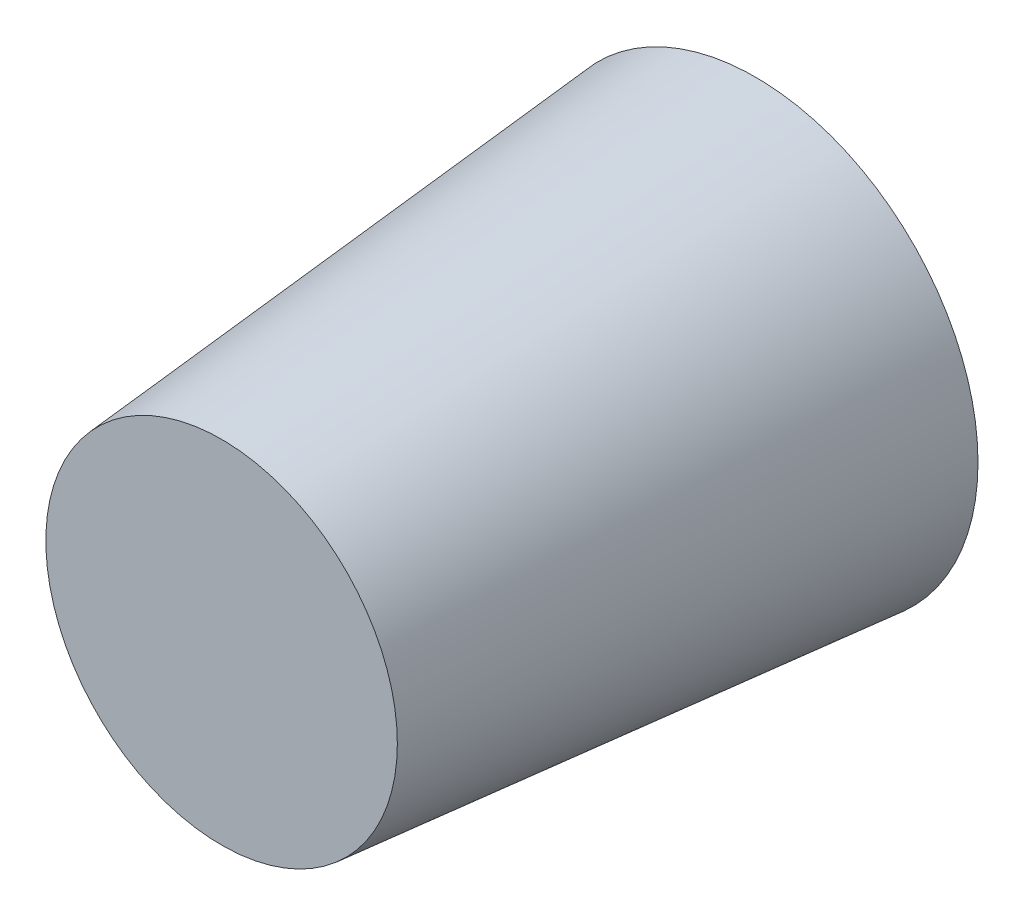
ISO-10303-21;
HEADER;
FILE_DESCRIPTION(('STEP AP214'),'2;1');
FILE_NAME('part.step','',(''),(''),'','','');
FILE_SCHEMA(('AUTOMOTIVE_DESIGN { 1 0 10303 214 1 1 1 1 }'));
ENDSEC;
DATA;
#1=APPLICATION_CONTEXT('core data for automotive mechanical design processes');
#2=APPLICATION_PROTOCOL_DEFINITION('international standard','automotive_design',2000,#1);
#3=PRODUCT_CONTEXT('',#1,'mechanical');
#4=PRODUCT('Part','Part','',(#3));
#5=PRODUCT_RELATED_PRODUCT_CATEGORY('part','',(#4));
#6=PRODUCT_DEFINITION_FORMATION('','',#4);
#7=PRODUCT_DEFINITION_CONTEXT('part definition',#1,'design');
#8=PRODUCT_DEFINITION('design','',#6,#7);
#9=PRODUCT_DEFINITION_SHAPE('','',#8);
#10=(LENGTH_UNIT() NAMED_UNIT(*) SI_UNIT(.MILLI.,.METRE.));
#11=(NAMED_UNIT(*) PLANE_ANGLE_UNIT() SI_UNIT($,.RADIAN.));
#12=(NAMED_UNIT(*) SI_UNIT($,.STERADIAN.) SOLID_ANGLE_UNIT());
#13=UNCERTAINTY_MEASURE_WITH_UNIT(LENGTH_MEASURE(1.E-05),#10,'distance_accuracy_value','');
#14=(GEOMETRIC_REPRESENTATION_CONTEXT(3) GLOBAL_UNCERTAINTY_ASSIGNED_CONTEXT((#13)) GLOBAL_UNIT_ASSIGNED_CONTEXT((#10,
#11,#12)) REPRESENTATION_CONTEXT('',''));
#15=CARTESIAN_POINT('',(0.,0.,0.));
#16=DIRECTION('',(0.,0.,1.));
#17=DIRECTION('',(1.,0.,0.));
#18=AXIS2_PLACEMENT_3D('',#15,#16,#17);
#19=CARTESIAN_POINT('',(75.0000000000001,144.,0.));
#20=DIRECTION('',(0.,0.,-1.));
#21=DIRECTION('',(1.,0.,0.));
#22=AXIS2_PLACEMENT_3D('',#19,#20,#21);
#23=CONICAL_SURFACE('',#22,2.50000000000001,0.0872664625997165);
#24=CARTESIAN_POINT('',(75.0000000000001,144.,5.99999999999998));
#25=DIRECTION('',(0.,0.,1.));
#26=DIRECTION('',(1.,0.,0.));
#27=AXIS2_PLACEMENT_3D('',#24,#25,#26);
#28=CIRCLE('',#27,1.97506801884447);
#29=CARTESIAN_POINT('',(76.9750680188445,144.,5.99999999999998));
#30=VERTEX_POINT('',#29);
#31=EDGE_CURVE('E10',#30,#30,#28,.T.);
#32=ORIENTED_EDGE('',*,*,#31,.F.);
#33=EDGE_LOOP('',(#32));
#34=FACE_BOUND('',#33,.T.);
#35=CARTESIAN_POINT('',(75.0000000000001,144.,0.));
#36=DIRECTION('',(0.,0.,1.));
#37=DIRECTION('',(1.,0.,0.));
#38=AXIS2_PLACEMENT_3D('',#35,#36,#37);
#39=CIRCLE('',#38,2.50000000000001);
#40=CARTESIAN_POINT('',(77.5000000000001,144.,0.));
#41=VERTEX_POINT('',#40);
#42=EDGE_CURVE('E45',#41,#41,#39,.T.);
#43=ORIENTED_EDGE('',*,*,#42,.T.);
#44=EDGE_LOOP('',(#43));
#45=FACE_BOUND('',#44,.T.);
#46=ADVANCED_FACE('F39',(#34,#45),#23,.T.);
#47=CARTESIAN_POINT('',(0.,0.,5.99999999999998));
#48=DIRECTION('',(0.,0.,1.));
#49=DIRECTION('',(1.,0.,0.));
#50=AXIS2_PLACEMENT_3D('',#47,#48,#49);
#51=PLANE('',#50);
#52=ORIENTED_EDGE('',*,*,#31,.T.);
#53=EDGE_LOOP('',(#52));
#54=FACE_BOUND('',#53,.T.);
#55=ADVANCED_FACE('F73',(#54),#51,.T.);
#56=CARTESIAN_POINT('',(0.,0.,0.));
#57=DIRECTION('',(0.,0.,1.));
#58=DIRECTION('',(1.,0.,0.));
#59=AXIS2_PLACEMENT_3D('',#56,#57,#58);
#60=PLANE('',#59);
#61=CARTESIAN_POINT('',(75.0000000000001,144.,0.));
#62=DIRECTION('',(0.,0.,1.));
#63=DIRECTION('',(1.,0.,0.));
#64=AXIS2_PLACEMENT_3D('',#61,#62,#63);
#65=CIRCLE('',#64,1.5);
#66=CARTESIAN_POINT('',(76.5000000000001,144.,0.));
#67=VERTEX_POINT('',#66);
#68=EDGE_CURVE('E53',#67,#67,#65,.T.);
#69=ORIENTED_EDGE('',*,*,#68,.T.);
#70=EDGE_LOOP('',(#69));
#71=FACE_BOUND('',#70,.T.);
#72=ORIENTED_EDGE('',*,*,#42,.F.);
#73=EDGE_LOOP('',(#72));
#74=FACE_BOUND('',#73,.T.);
#75=ADVANCED_FACE('F59',(#71,#74),#60,.F.);
#76=CARTESIAN_POINT('',(75.0000000000001,144.,0.));
#77=DIRECTION('',(0.,0.,-1.));
#78=DIRECTION('',(1.,0.,0.));
#79=AXIS2_PLACEMENT_3D('',#76,#77,#78);
#80=CONICAL_SURFACE('',#79,1.5,0.0872664625997165);
#81=CARTESIAN_POINT('',(75.0000000000001,144.,5.5));
#82=DIRECTION('',(0.,0.,1.));
#83=DIRECTION('',(1.,0.,0.));
#84=AXIS2_PLACEMENT_3D('',#81,#82,#83);
#85=CIRCLE('',#84,1.01881235060742);
#86=CARTESIAN_POINT('',(76.0188123506075,144.,5.5));
#87=VERTEX_POINT('',#86);
#88=EDGE_CURVE('E49',#87,#87,#85,.T.);
#89=ORIENTED_EDGE('',*,*,#88,.T.);
#90=EDGE_LOOP('',(#89));
#91=FACE_BOUND('',#90,.T.);
#92=ORIENTED_EDGE('',*,*,#68,.F.);
#93=EDGE_LOOP('',(#92));
#94=FACE_BOUND('',#93,.T.);
#95=ADVANCED_FACE('F62',(#91,#94),#80,.F.);
#96=CARTESIAN_POINT('',(0.,0.,5.5));
#97=DIRECTION('',(0.,0.,1.));
#98=DIRECTION('',(1.,0.,0.));
#99=AXIS2_PLACEMENT_3D('',#96,#97,#98);
#100=PLANE('',#99);
#101=ORIENTED_EDGE('',*,*,#88,.F.);
#102=EDGE_LOOP('',(#101));
#103=FACE_BOUND('',#102,.T.);
#104=ADVANCED_FACE('F64',(#103),#100,.F.);
#105=CLOSED_SHELL('',(#46,#55,#75,#95,#104));
#106=MANIFOLD_SOLID_BREP('B2',#105);
#107=ADVANCED_BREP_SHAPE_REPRESENTATION('',(#18,#106),#14);
#108=SHAPE_DEFINITION_REPRESENTATION(#9,#107);
ENDSEC;
END-ISO-10303-21;
